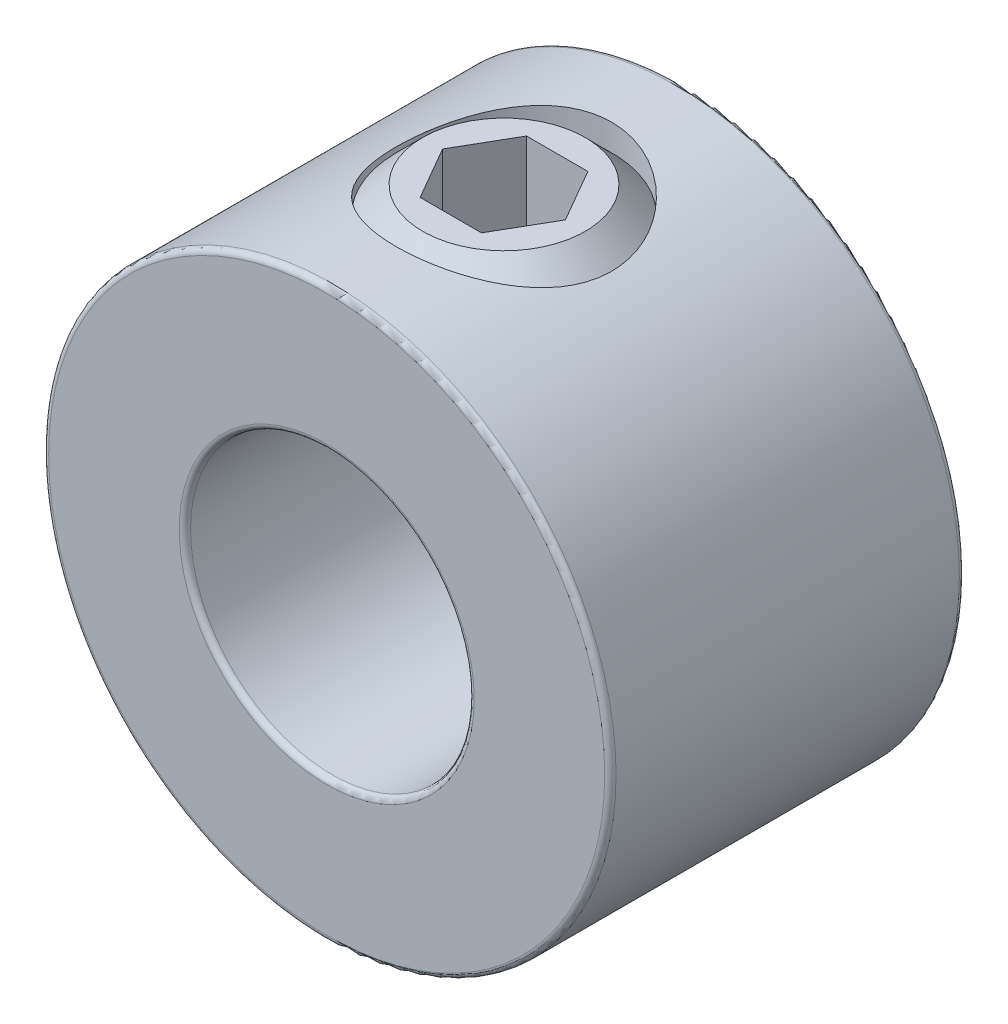
ISO-10303-21;
HEADER;
FILE_DESCRIPTION(('STEP AP214'),'2;1');
FILE_NAME('part.step','',(''),(''),'','','');
FILE_SCHEMA(('AUTOMOTIVE_DESIGN { 1 0 10303 214 1 1 1 1 }'));
ENDSEC;
DATA;
#1=APPLICATION_CONTEXT('core data for automotive mechanical design processes');
#2=APPLICATION_PROTOCOL_DEFINITION('international standard','automotive_design',2000,#1);
#3=PRODUCT_CONTEXT('',#1,'mechanical');
#4=PRODUCT('Part','Part','',(#3));
#5=PRODUCT_RELATED_PRODUCT_CATEGORY('part','',(#4));
#6=PRODUCT_DEFINITION_FORMATION('','',#4);
#7=PRODUCT_DEFINITION_CONTEXT('part definition',#1,'design');
#8=PRODUCT_DEFINITION('design','',#6,#7);
#9=PRODUCT_DEFINITION_SHAPE('','',#8);
#10=(LENGTH_UNIT() NAMED_UNIT(*) SI_UNIT(.MILLI.,.METRE.));
#11=(NAMED_UNIT(*) PLANE_ANGLE_UNIT() SI_UNIT($,.RADIAN.));
#12=(NAMED_UNIT(*) SI_UNIT($,.STERADIAN.) SOLID_ANGLE_UNIT());
#13=UNCERTAINTY_MEASURE_WITH_UNIT(LENGTH_MEASURE(1.E-05),#10,'distance_accuracy_value','');
#14=(GEOMETRIC_REPRESENTATION_CONTEXT(3) GLOBAL_UNCERTAINTY_ASSIGNED_CONTEXT((#13)) GLOBAL_UNIT_ASSIGNED_CONTEXT((#10,
#11,#12)) REPRESENTATION_CONTEXT('',''));
#15=CARTESIAN_POINT('',(0.,0.,0.));
#16=DIRECTION('',(0.,0.,1.));
#17=DIRECTION('',(1.,0.,0.));
#18=AXIS2_PLACEMENT_3D('',#15,#16,#17);
#19=CARTESIAN_POINT('',(0.,6.35,0.));
#20=DIRECTION('',(0.,1.,0.));
#21=DIRECTION('',(-1.,0.,0.));
#22=AXIS2_PLACEMENT_3D('',#19,#20,#21);
#23=PLANE('',#22);
#24=CARTESIAN_POINT('',(0.,6.35,0.));
#25=DIRECTION('',(0.,1.,0.));
#26=DIRECTION('',(-1.,0.,0.));
#27=AXIS2_PLACEMENT_3D('',#24,#25,#26);
#28=CIRCLE('',#27,1.81975161629017);
#29=CARTESIAN_POINT('',(-1.81975161629017,6.35,0.));
#30=VERTEX_POINT('',#29);
#31=EDGE_CURVE('E12',#30,#30,#28,.T.);
#32=ORIENTED_EDGE('',*,*,#31,.T.);
#33=EDGE_LOOP('',(#32));
#34=FACE_BOUND('',#33,.T.);
#35=DIRECTION('',(1.,0.,0.));
#36=VECTOR('',#35,1.);
#37=CARTESIAN_POINT('',(-0.687407664253899,6.34999999999999,-1.190625));
#38=LINE('',#37,#36);
#39=CARTESIAN_POINT('',(-0.687407664253899,6.34999999999999,-1.190625));
#40=VERTEX_POINT('',#39);
#41=CARTESIAN_POINT('',(0.687407664253899,6.35,-1.190625));
#42=VERTEX_POINT('',#41);
#43=EDGE_CURVE('E110',#40,#42,#38,.T.);
#44=ORIENTED_EDGE('',*,*,#43,.T.);
#45=DIRECTION('',(0.5,0.,0.866025403784439));
#46=VECTOR('',#45,1.);
#47=CARTESIAN_POINT('',(0.687407664253899,6.34999999999999,-1.190625));
#48=LINE('',#47,#46);
#49=CARTESIAN_POINT('',(1.3748153285078,6.34999999999999,0.));
#50=VERTEX_POINT('',#49);
#51=EDGE_CURVE('E56',#42,#50,#48,.T.);
#52=ORIENTED_EDGE('',*,*,#51,.T.);
#53=DIRECTION('',(-0.5,0.,0.866025403784439));
#54=VECTOR('',#53,1.);
#55=CARTESIAN_POINT('',(1.3748153285078,6.34999999999999,0.));
#56=LINE('',#55,#54);
#57=CARTESIAN_POINT('',(0.687407664253899,6.34999999999999,1.190625));
#58=VERTEX_POINT('',#57);
#59=EDGE_CURVE('E114',#50,#58,#56,.T.);
#60=ORIENTED_EDGE('',*,*,#59,.T.);
#61=DIRECTION('',(-1.,0.,0.));
#62=VECTOR('',#61,1.);
#63=CARTESIAN_POINT('',(0.687407664253899,6.34999999999999,1.190625));
#64=LINE('',#63,#62);
#65=CARTESIAN_POINT('',(-0.687407664253899,6.34999999999999,1.190625));
#66=VERTEX_POINT('',#65);
#67=EDGE_CURVE('E177',#58,#66,#64,.T.);
#68=ORIENTED_EDGE('',*,*,#67,.T.);
#69=DIRECTION('',(-0.5,0.,-0.866025403784439));
#70=VECTOR('',#69,1.);
#71=CARTESIAN_POINT('',(-0.687407664253899,6.34999999999999,1.190625));
#72=LINE('',#71,#70);
#73=CARTESIAN_POINT('',(-1.3748153285078,6.34999999999999,0.));
#74=VERTEX_POINT('',#73);
#75=EDGE_CURVE('E162',#66,#74,#72,.T.);
#76=ORIENTED_EDGE('',*,*,#75,.T.);
#77=DIRECTION('',(0.5,0.,-0.866025403784439));
#78=VECTOR('',#77,1.);
#79=CARTESIAN_POINT('',(-1.3748153285078,6.34999999999999,0.));
#80=LINE('',#79,#78);
#81=EDGE_CURVE('E158',#74,#40,#80,.T.);
#82=ORIENTED_EDGE('',*,*,#81,.T.);
#83=EDGE_LOOP('',(#44,#52,#60,#68,#76,#82));
#84=FACE_BOUND('',#83,.T.);
#85=ADVANCED_FACE('F42',(#34,#84),#23,.T.);
#86=CARTESIAN_POINT('',(0.,6.35,0.));
#87=DIRECTION('',(0.,-1.,0.));
#88=DIRECTION('',(1.,0.,0.));
#89=AXIS2_PLACEMENT_3D('',#86,#87,#88);
#90=CONICAL_SURFACE('',#89,1.81975161629017,0.785398163397449);
#91=CARTESIAN_POINT('',(0.,5.75675161629017,0.));
#92=DIRECTION('',(0.,1.,0.));
#93=DIRECTION('',(-1.,0.,0.));
#94=AXIS2_PLACEMENT_3D('',#91,#92,#93);
#95=CIRCLE('',#94,2.413);
#96=CARTESIAN_POINT('',(-2.413,5.75675161629017,0.));
#97=VERTEX_POINT('',#96);
#98=EDGE_CURVE('E49',#97,#97,#95,.T.);
#99=ORIENTED_EDGE('',*,*,#98,.T.);
#100=EDGE_LOOP('',(#99));
#101=FACE_BOUND('',#100,.T.);
#102=ORIENTED_EDGE('',*,*,#31,.F.);
#103=EDGE_LOOP('',(#102));
#104=FACE_BOUND('',#103,.T.);
#105=ADVANCED_FACE('F132',(#101,#104),#90,.T.);
#106=CARTESIAN_POINT('',(0.,3.175,0.));
#107=DIRECTION('',(0.,1.,0.));
#108=DIRECTION('',(-1.,0.,0.));
#109=AXIS2_PLACEMENT_3D('',#106,#107,#108);
#110=CYLINDRICAL_SURFACE('',#109,2.413);
#111=CARTESIAN_POINT('',(0.,3.76824838370983,0.));
#112=DIRECTION('',(0.,1.,0.));
#113=DIRECTION('',(-1.,0.,0.));
#114=AXIS2_PLACEMENT_3D('',#111,#112,#113);
#115=CIRCLE('',#114,2.413);
#116=CARTESIAN_POINT('',(-2.413,3.76824838370983,0.));
#117=VERTEX_POINT('',#116);
#118=EDGE_CURVE('E127',#117,#117,#115,.T.);
#119=ORIENTED_EDGE('',*,*,#118,.T.);
#120=EDGE_LOOP('',(#119));
#121=FACE_BOUND('',#120,.T.);
#122=ORIENTED_EDGE('',*,*,#98,.F.);
#123=EDGE_LOOP('',(#122));
#124=FACE_BOUND('',#123,.T.);
#125=ADVANCED_FACE('F135',(#121,#124),#110,.T.);
#126=CARTESIAN_POINT('',(0.,3.76824838370983,0.));
#127=DIRECTION('',(0.,1.,0.));
#128=DIRECTION('',(-1.,0.,0.));
#129=AXIS2_PLACEMENT_3D('',#126,#127,#128);
#130=CONICAL_SURFACE('',#129,2.413,0.785398163397448);
#131=CARTESIAN_POINT('',(0.,3.175,0.));
#132=DIRECTION('',(0.,1.,0.));
#133=DIRECTION('',(-1.,0.,0.));
#134=AXIS2_PLACEMENT_3D('',#131,#132,#133);
#135=CIRCLE('',#134,1.81975161629017);
#136=CARTESIAN_POINT('',(-1.81975161629017,3.175,0.));
#137=VERTEX_POINT('',#136);
#138=EDGE_CURVE('E119',#137,#137,#135,.T.);
#139=ORIENTED_EDGE('',*,*,#138,.T.);
#140=EDGE_LOOP('',(#139));
#141=FACE_BOUND('',#140,.T.);
#142=ORIENTED_EDGE('',*,*,#118,.F.);
#143=EDGE_LOOP('',(#142));
#144=FACE_BOUND('',#143,.T.);
#145=ADVANCED_FACE('F137',(#141,#144),#130,.T.);
#146=CARTESIAN_POINT('',(-1.81975161629017,3.175,0.));
#147=DIRECTION('',(0.,-1.,0.));
#148=DIRECTION('',(1.,0.,0.));
#149=AXIS2_PLACEMENT_3D('',#146,#147,#148);
#150=PLANE('',#149);
#151=CARTESIAN_POINT('',(0.,3.175,0.));
#152=DIRECTION('',(0.,1.,0.));
#153=DIRECTION('',(-1.,0.,0.));
#154=AXIS2_PLACEMENT_3D('',#151,#152,#153);
#155=CIRCLE('',#154,0.711898060451796);
#156=CARTESIAN_POINT('',(-0.711898060451796,3.175,0.));
#157=VERTEX_POINT('',#156);
#158=EDGE_CURVE('E115',#157,#157,#155,.T.);
#159=ORIENTED_EDGE('',*,*,#158,.T.);
#160=EDGE_LOOP('',(#159));
#161=FACE_BOUND('',#160,.T.);
#162=ORIENTED_EDGE('',*,*,#138,.F.);
#163=EDGE_LOOP('',(#162));
#164=FACE_BOUND('',#163,.T.);
#165=ADVANCED_FACE('F144',(#161,#164),#150,.T.);
#166=CARTESIAN_POINT('',(0.,3.175,0.));
#167=DIRECTION('',(0.,-1.,0.));
#168=DIRECTION('',(1.,0.,0.));
#169=AXIS2_PLACEMENT_3D('',#166,#167,#168);
#170=CONICAL_SURFACE('',#169,0.711898060451796,0.785398163397448);
#171=CARTESIAN_POINT('',(0.,3.8868980604518,0.));
#172=VERTEX_POINT('',#171);
#173=VERTEX_LOOP('',#172);
#174=FACE_BOUND('',#173,.T.);
#175=ORIENTED_EDGE('',*,*,#158,.F.);
#176=EDGE_LOOP('',(#175));
#177=FACE_BOUND('',#176,.T.);
#178=ADVANCED_FACE('F211',(#174,#177),#170,.F.);
#179=CARTESIAN_POINT('',(0.687407664253899,3.96874999999999,-1.190625));
#180=DIRECTION('',(-0.866025403784439,0.,0.5));
#181=DIRECTION('',(0.5,0.,0.866025403784438));
#182=AXIS2_PLACEMENT_3D('',#179,#180,#181);
#183=PLANE('',#182);
#184=ORIENTED_EDGE('',*,*,#51,.F.);
#185=DIRECTION('',(0.,1.,0.));
#186=VECTOR('',#185,1.);
#187=CARTESIAN_POINT('',(0.687407664253899,3.96874999999999,-1.190625));
#188=LINE('',#187,#186);
#189=CARTESIAN_POINT('',(0.687407664253899,3.96874999999999,-1.190625));
#190=VERTEX_POINT('',#189);
#191=EDGE_CURVE('E109',#190,#42,#188,.T.);
#192=ORIENTED_EDGE('',*,*,#191,.F.);
#193=DIRECTION('',(0.5,0.,0.866025403784439));
#194=VECTOR('',#193,1.);
#195=CARTESIAN_POINT('',(0.687407664253899,3.96874999999999,-1.190625));
#196=LINE('',#195,#194);
#197=CARTESIAN_POINT('',(1.3748153285078,3.96874999999999,0.));
#198=VERTEX_POINT('',#197);
#199=EDGE_CURVE('E100',#190,#198,#196,.T.);
#200=ORIENTED_EDGE('',*,*,#199,.T.);
#201=DIRECTION('',(0.,1.,0.));
#202=VECTOR('',#201,1.);
#203=CARTESIAN_POINT('',(1.3748153285078,3.96874999999999,0.));
#204=LINE('',#203,#202);
#205=EDGE_CURVE('E108',#198,#50,#204,.T.);
#206=ORIENTED_EDGE('',*,*,#205,.T.);
#207=EDGE_LOOP('',(#184,#192,#200,#206));
#208=FACE_BOUND('',#207,.T.);
#209=ADVANCED_FACE('F107',(#208),#183,.T.);
#210=CARTESIAN_POINT('',(1.3748153285078,3.96874999999999,0.));
#211=DIRECTION('',(-0.866025403784439,0.,-0.5));
#212=DIRECTION('',(-0.5,0.,0.866025403784439));
#213=AXIS2_PLACEMENT_3D('',#210,#211,#212);
#214=PLANE('',#213);
#215=ORIENTED_EDGE('',*,*,#59,.F.);
#216=ORIENTED_EDGE('',*,*,#205,.F.);
#217=DIRECTION('',(-0.5,0.,0.866025403784439));
#218=VECTOR('',#217,1.);
#219=CARTESIAN_POINT('',(1.3748153285078,3.96874999999999,0.));
#220=LINE('',#219,#218);
#221=CARTESIAN_POINT('',(0.687407664253899,3.96874999999999,1.190625));
#222=VERTEX_POINT('',#221);
#223=EDGE_CURVE('E96',#198,#222,#220,.T.);
#224=ORIENTED_EDGE('',*,*,#223,.T.);
#225=DIRECTION('',(0.,1.,0.));
#226=VECTOR('',#225,1.);
#227=CARTESIAN_POINT('',(0.687407664253899,3.96874999999999,1.190625));
#228=LINE('',#227,#226);
#229=EDGE_CURVE('E116',#222,#58,#228,.T.);
#230=ORIENTED_EDGE('',*,*,#229,.T.);
#231=EDGE_LOOP('',(#215,#216,#224,#230));
#232=FACE_BOUND('',#231,.T.);
#233=ADVANCED_FACE('F112',(#232),#214,.T.);
#234=CARTESIAN_POINT('',(0.687407664253899,3.96874999999999,1.190625));
#235=DIRECTION('',(0.,0.,-1.));
#236=DIRECTION('',(-1.,0.,0.));
#237=AXIS2_PLACEMENT_3D('',#234,#235,#236);
#238=PLANE('',#237);
#239=ORIENTED_EDGE('',*,*,#67,.F.);
#240=ORIENTED_EDGE('',*,*,#229,.F.);
#241=DIRECTION('',(-1.,0.,0.));
#242=VECTOR('',#241,1.);
#243=CARTESIAN_POINT('',(0.687407664253899,3.96874999999999,1.190625));
#244=LINE('',#243,#242);
#245=CARTESIAN_POINT('',(-0.687407664253899,3.96874999999999,1.190625));
#246=VERTEX_POINT('',#245);
#247=EDGE_CURVE('E102',#222,#246,#244,.T.);
#248=ORIENTED_EDGE('',*,*,#247,.T.);
#249=DIRECTION('',(0.,1.,0.));
#250=VECTOR('',#249,1.);
#251=CARTESIAN_POINT('',(-0.687407664253899,3.96874999999999,1.190625));
#252=LINE('',#251,#250);
#253=EDGE_CURVE('E121',#246,#66,#252,.T.);
#254=ORIENTED_EDGE('',*,*,#253,.T.);
#255=EDGE_LOOP('',(#239,#240,#248,#254));
#256=FACE_BOUND('',#255,.T.);
#257=ADVANCED_FACE('F175',(#256),#238,.T.);
#258=CARTESIAN_POINT('',(-0.687407664253899,3.96874999999999,1.190625));
#259=DIRECTION('',(0.866025403784439,0.,-0.5));
#260=DIRECTION('',(-0.5,0.,-0.866025403784439));
#261=AXIS2_PLACEMENT_3D('',#258,#259,#260);
#262=PLANE('',#261);
#263=ORIENTED_EDGE('',*,*,#75,.F.);
#264=ORIENTED_EDGE('',*,*,#253,.F.);
#265=DIRECTION('',(-0.5,0.,-0.866025403784439));
#266=VECTOR('',#265,1.);
#267=CARTESIAN_POINT('',(-0.687407664253899,3.96874999999999,1.190625));
#268=LINE('',#267,#266);
#269=CARTESIAN_POINT('',(-1.3748153285078,3.96874999999999,0.));
#270=VERTEX_POINT('',#269);
#271=EDGE_CURVE('E188',#246,#270,#268,.T.);
#272=ORIENTED_EDGE('',*,*,#271,.T.);
#273=DIRECTION('',(0.,1.,0.));
#274=VECTOR('',#273,1.);
#275=CARTESIAN_POINT('',(-1.3748153285078,3.96874999999999,0.));
#276=LINE('',#275,#274);
#277=EDGE_CURVE('E170',#270,#74,#276,.T.);
#278=ORIENTED_EDGE('',*,*,#277,.T.);
#279=EDGE_LOOP('',(#263,#264,#272,#278));
#280=FACE_BOUND('',#279,.T.);
#281=ADVANCED_FACE('F179',(#280),#262,.T.);
#282=CARTESIAN_POINT('',(-1.3748153285078,3.96874999999999,0.));
#283=DIRECTION('',(0.866025403784439,0.,0.5));
#284=DIRECTION('',(0.5,0.,-0.866025403784439));
#285=AXIS2_PLACEMENT_3D('',#282,#283,#284);
#286=PLANE('',#285);
#287=ORIENTED_EDGE('',*,*,#81,.F.);
#288=ORIENTED_EDGE('',*,*,#277,.F.);
#289=DIRECTION('',(0.5,0.,-0.866025403784439));
#290=VECTOR('',#289,1.);
#291=CARTESIAN_POINT('',(-1.3748153285078,3.96874999999999,0.));
#292=LINE('',#291,#290);
#293=CARTESIAN_POINT('',(-0.687407664253899,3.96874999999999,-1.190625));
#294=VERTEX_POINT('',#293);
#295=EDGE_CURVE('E186',#270,#294,#292,.T.);
#296=ORIENTED_EDGE('',*,*,#295,.T.);
#297=DIRECTION('',(0.,1.,0.));
#298=VECTOR('',#297,1.);
#299=CARTESIAN_POINT('',(-0.687407664253899,3.96874999999999,-1.190625));
#300=LINE('',#299,#298);
#301=EDGE_CURVE('E167',#294,#40,#300,.T.);
#302=ORIENTED_EDGE('',*,*,#301,.T.);
#303=EDGE_LOOP('',(#287,#288,#296,#302));
#304=FACE_BOUND('',#303,.T.);
#305=ADVANCED_FACE('F192',(#304),#286,.T.);
#306=CARTESIAN_POINT('',(-0.687407664253899,3.96874999999999,-1.190625));
#307=DIRECTION('',(0.,0.,1.));
#308=DIRECTION('',(1.,0.,0.));
#309=AXIS2_PLACEMENT_3D('',#306,#307,#308);
#310=PLANE('',#309);
#311=ORIENTED_EDGE('',*,*,#43,.F.);
#312=ORIENTED_EDGE('',*,*,#301,.F.);
#313=DIRECTION('',(1.,0.,0.));
#314=VECTOR('',#313,1.);
#315=CARTESIAN_POINT('',(-0.687407664253899,3.96874999999999,-1.190625));
#316=LINE('',#315,#314);
#317=EDGE_CURVE('E168',#294,#190,#316,.T.);
#318=ORIENTED_EDGE('',*,*,#317,.T.);
#319=ORIENTED_EDGE('',*,*,#191,.T.);
#320=EDGE_LOOP('',(#311,#312,#318,#319));
#321=FACE_BOUND('',#320,.T.);
#322=ADVANCED_FACE('F193',(#321),#310,.T.);
#323=CARTESIAN_POINT('',(1.3748153285078,3.96874999999999,0.));
#324=DIRECTION('',(0.,-1.,0.));
#325=DIRECTION('',(0.,0.,-1.));
#326=AXIS2_PLACEMENT_3D('',#323,#324,#325);
#327=PLANE('',#326);
#328=ORIENTED_EDGE('',*,*,#199,.F.);
#329=ORIENTED_EDGE('',*,*,#317,.F.);
#330=ORIENTED_EDGE('',*,*,#295,.F.);
#331=ORIENTED_EDGE('',*,*,#271,.F.);
#332=ORIENTED_EDGE('',*,*,#247,.F.);
#333=ORIENTED_EDGE('',*,*,#223,.F.);
#334=EDGE_LOOP('',(#328,#329,#330,#331,#332,#333));
#335=FACE_BOUND('',#334,.T.);
#336=ADVANCED_FACE('F98',(#335),#327,.F.);
#337=CLOSED_SHELL('',(#85,#105,#125,#145,#165,#178,#209,#233,#257,#281,#305,#322,#336));
#338=MANIFOLD_SOLID_BREP('B2',#337);
#339=CARTESIAN_POINT('',(0.,0.,3.96875));
#340=DIRECTION('',(0.,0.,1.));
#341=DIRECTION('',(1.,0.,0.));
#342=AXIS2_PLACEMENT_3D('',#339,#340,#341);
#343=PLANE('',#342);
#344=CARTESIAN_POINT('',(0.,0.,3.96875));
#345=DIRECTION('',(0.,0.,1.));
#346=DIRECTION('',(1.,0.,0.));
#347=AXIS2_PLACEMENT_3D('',#344,#345,#346);
#348=CIRCLE('',#347,3.302);
#349=CARTESIAN_POINT('',(3.302,0.,3.96875));
#350=VERTEX_POINT('',#349);
#351=EDGE_CURVE('E307',#350,#350,#348,.F.);
#352=ORIENTED_EDGE('',*,*,#351,.T.);
#353=EDGE_LOOP('',(#352));
#354=FACE_BOUND('',#353,.T.);
#355=CARTESIAN_POINT('',(0.,0.,3.96875));
#356=DIRECTION('',(0.,0.,1.));
#357=DIRECTION('',(1.,0.,0.));
#358=AXIS2_PLACEMENT_3D('',#355,#356,#357);
#359=CIRCLE('',#358,6.223);
#360=CARTESIAN_POINT('',(6.223,0.,3.96875));
#361=VERTEX_POINT('',#360);
#362=EDGE_CURVE('E311',#361,#361,#359,.T.);
#363=ORIENTED_EDGE('',*,*,#362,.T.);
#364=EDGE_LOOP('',(#363));
#365=FACE_BOUND('',#364,.T.);
#366=ADVANCED_FACE('F296',(#354,#365),#343,.T.);
#367=CARTESIAN_POINT('',(0.,0.,-3.96875));
#368=DIRECTION('',(0.,0.,1.));
#369=DIRECTION('',(1.,0.,0.));
#370=AXIS2_PLACEMENT_3D('',#367,#368,#369);
#371=PLANE('',#370);
#372=CARTESIAN_POINT('',(0.,0.,-3.96875));
#373=DIRECTION('',(0.,0.,1.));
#374=DIRECTION('',(1.,0.,0.));
#375=AXIS2_PLACEMENT_3D('',#372,#373,#374);
#376=CIRCLE('',#375,3.302);
#377=CARTESIAN_POINT('',(3.302,0.,-3.96875));
#378=VERTEX_POINT('',#377);
#379=EDGE_CURVE('E322',#378,#378,#376,.T.);
#380=ORIENTED_EDGE('',*,*,#379,.T.);
#381=EDGE_LOOP('',(#380));
#382=FACE_BOUND('',#381,.T.);
#383=CARTESIAN_POINT('',(0.,0.,-3.96875));
#384=DIRECTION('',(0.,0.,1.));
#385=DIRECTION('',(1.,0.,0.));
#386=AXIS2_PLACEMENT_3D('',#383,#384,#385);
#387=CIRCLE('',#386,6.223);
#388=CARTESIAN_POINT('',(6.223,0.,-3.96875));
#389=VERTEX_POINT('',#388);
#390=EDGE_CURVE('E325',#389,#389,#387,.F.);
#391=ORIENTED_EDGE('',*,*,#390,.T.);
#392=EDGE_LOOP('',(#391));
#393=FACE_BOUND('',#392,.T.);
#394=ADVANCED_FACE('F359',(#382,#393),#371,.F.);
#395=CARTESIAN_POINT('',(0.,0.,3.96875));
#396=DIRECTION('',(0.,0.,-1.));
#397=DIRECTION('',(-1.,0.,0.));
#398=AXIS2_PLACEMENT_3D('',#395,#396,#397);
#399=CYLINDRICAL_SURFACE('',#398,6.35);
#400=CARTESIAN_POINT('',(0.,0.,-3.84175));
#401=DIRECTION('',(0.,0.,1.));
#402=DIRECTION('',(1.,0.,0.));
#403=AXIS2_PLACEMENT_3D('',#400,#401,#402);
#404=CIRCLE('',#403,6.35);
#405=CARTESIAN_POINT('',(6.35,0.,-3.84175));
#406=VERTEX_POINT('',#405);
#407=EDGE_CURVE('E41',#406,#406,#404,.T.);
#408=ORIENTED_EDGE('',*,*,#407,.T.);
#409=EDGE_LOOP('',(#408));
#410=FACE_BOUND('',#409,.T.);
#411=CARTESIAN_POINT('',(0.,0.,3.84175));
#412=DIRECTION('',(0.,0.,1.));
#413=DIRECTION('',(1.,0.,0.));
#414=AXIS2_PLACEMENT_3D('',#411,#412,#413);
#415=CIRCLE('',#414,6.35);
#416=CARTESIAN_POINT('',(6.35,0.,3.84175));
#417=VERTEX_POINT('',#416);
#418=EDGE_CURVE('E303',#417,#417,#415,.F.);
#419=ORIENTED_EDGE('',*,*,#418,.T.);
#420=EDGE_LOOP('',(#419));
#421=FACE_BOUND('',#420,.T.);
#422=CARTESIAN_POINT('',(0.,6.35,-2.413));
#423=CARTESIAN_POINT('',(0.130555931467962,6.35000398969011,-2.41300527534602));
#424=CARTESIAN_POINT('',(0.261076241377739,6.34593890816647,-2.4023714543113));
#425=CARTESIAN_POINT('',(0.518209446534913,6.33012963929965,-2.36029479676423));
#426=CARTESIAN_POINT('',(0.644823015088655,6.31838678300935,-2.32885556715778));
#427=CARTESIAN_POINT('',(0.890396734122701,6.28848040494,-2.24644511602075));
#428=CARTESIAN_POINT('',(1.00937135935963,6.27032947705095,-2.19551218938446));
#429=CARTESIAN_POINT('',(1.23707694907279,6.22940932060409,-2.07575764561934));
#430=CARTESIAN_POINT('',(1.34580507871092,6.20663881943741,-2.00693109764769));
#431=CARTESIAN_POINT('',(1.5546544090621,6.15771932779737,-1.85022277092613));
#432=CARTESIAN_POINT('',(1.65427192875035,6.13147296383124,-1.76170041624995));
#433=CARTESIAN_POINT('',(1.83765571561736,6.07903240405007,-1.56947315042905));
#434=CARTESIAN_POINT('',(1.92141693988139,6.05283822744466,-1.46576342765122));
#435=CARTESIAN_POINT('',(2.07395660623911,6.00232668170519,-1.24113386470124));
#436=CARTESIAN_POINT('',(2.14201618015845,5.97812365120729,-1.11969756154783));
#437=CARTESIAN_POINT('',(2.25652093858858,5.93585432476053,-0.866038380432351));
#438=CARTESIAN_POINT('',(2.30297502037546,5.91778550353544,-0.733819969020803));
#439=CARTESIAN_POINT('',(2.37094947712185,5.89087364983883,-0.46815363189803));
#440=CARTESIAN_POINT('',(2.39343294050412,5.88167580744491,-0.334989300795486));
#441=CARTESIAN_POINT('',(2.41583880524757,5.87251090464605,-0.0664845962936197));
#442=CARTESIAN_POINT('',(2.41577084821779,5.87253989940926,0.0688548224232351));
#443=CARTESIAN_POINT('',(2.39381090108878,5.88152011871453,0.328972227003014));
#444=CARTESIAN_POINT('',(2.37326609797153,5.88992057372023,0.453886522563246));
#445=CARTESIAN_POINT('',(2.31316652422954,5.91378008823147,0.698339704990829));
#446=CARTESIAN_POINT('',(2.27360881167116,5.92924024008996,0.817877756841903));
#447=CARTESIAN_POINT('',(2.17588364092748,5.96580146890692,1.0508916152852));
#448=CARTESIAN_POINT('',(2.11737290423754,5.98700531598431,1.16420661484106));
#449=CARTESIAN_POINT('',(1.98364217411328,6.03263175509447,1.37979639920587));
#450=CARTESIAN_POINT('',(1.90841630395244,6.05705547794376,1.4820672822727));
#451=CARTESIAN_POINT('',(1.73726689770536,6.10842961274997,1.68010694238863));
#452=CARTESIAN_POINT('',(1.64027173491613,6.13543795015635,1.77493688260015));
#453=CARTESIAN_POINT('',(1.43144868882472,6.18748920351012,1.94726806056401));
#454=CARTESIAN_POINT('',(1.31961840653187,6.2125318005324,2.02476649017818));
#455=CARTESIAN_POINT('',(1.08185265975391,6.25835188225341,2.16130771487283));
#456=CARTESIAN_POINT('',(0.955717417234618,6.27905339803369,2.22002994310971));
#457=CARTESIAN_POINT('',(0.694375189035109,6.31329326294077,2.31510736575226));
#458=CARTESIAN_POINT('',(0.559172376611221,6.32683488218724,2.3514727723643));
#459=CARTESIAN_POINT('',(0.291428150212525,6.3446501972992,2.39898109857718));
#460=CARTESIAN_POINT('',(0.159141645079808,6.34938771868047,2.41138775288999));
#461=CARTESIAN_POINT('',(-0.105693065348276,6.35049981057155,2.41431626348443));
#462=CARTESIAN_POINT('',(-0.238241203822052,6.34687629478166,2.40484312768025));
#463=CARTESIAN_POINT('',(-0.494323602805378,6.33197908606406,2.36523562382545));
#464=CARTESIAN_POINT('',(-0.61800684441211,6.32101461634214,2.33593589818825));
#465=CARTESIAN_POINT('',(-0.858609565436108,6.29285092848222,2.25861304376362));
#466=CARTESIAN_POINT('',(-0.975528163914414,6.27565090041604,2.21058748264173));
#467=CARTESIAN_POINT('',(-1.20317276582384,6.23607457125026,2.09563503714011));
#468=CARTESIAN_POINT('',(-1.3136121499673,6.21355984396609,2.02818967610491));
#469=CARTESIAN_POINT('',(-1.52197988578177,6.16583504517286,1.87689595883598));
#470=CARTESIAN_POINT('',(-1.61990351002366,6.14062396176678,1.79304143465584));
#471=CARTESIAN_POINT('',(-1.80656807112922,6.08841217199752,1.60543272496061));
#472=CARTESIAN_POINT('',(-1.89441393314817,6.06139435477813,1.5007904098217));
#473=CARTESIAN_POINT('',(-2.05148411432654,6.01005496187559,1.27772800811267));
#474=CARTESIAN_POINT('',(-2.12070651399853,5.98573366426972,1.15930650314625));
#475=CARTESIAN_POINT('',(-2.23870023772464,5.94261798623815,0.910922748538602));
#476=CARTESIAN_POINT('',(-2.28736466342468,5.92385264334907,0.780904332023381));
#477=CARTESIAN_POINT('',(-2.36177800946808,5.89458517077402,0.513602694331982));
#478=CARTESIAN_POINT('',(-2.38754162954713,5.8840777409413,0.376324193363579));
#479=CARTESIAN_POINT('',(-2.41408994040532,5.87323215610138,0.108127165215383));
#480=CARTESIAN_POINT('',(-2.41640623148607,5.87227054588007,-0.0226157343841075));
#481=CARTESIAN_POINT('',(-2.3999373204655,5.8790202253426,-0.282524873396556));
#482=CARTESIAN_POINT('',(-2.38115423316032,5.88673064582666,-0.41169126951125));
#483=CARTESIAN_POINT('',(-2.32422421188573,5.90943043237583,-0.660552265849344));
#484=CARTESIAN_POINT('',(-2.28672002796391,5.92417751295514,-0.780417919491674));
#485=CARTESIAN_POINT('',(-2.19398528189399,5.95914188552999,-1.01222145618602));
#486=CARTESIAN_POINT('',(-2.13875018285588,5.97936057736356,-1.12415730124382));
#487=CARTESIAN_POINT('',(-2.00869997639504,6.02433337271119,-1.34342800575803));
#488=CARTESIAN_POINT('',(-1.93299650808671,6.04927206356278,-1.4501976241717));
#489=CARTESIAN_POINT('',(-1.76551836882645,6.10025417003155,-1.65000619367226));
#490=CARTESIAN_POINT('',(-1.67373852090438,6.12629793945648,-1.74304070389426));
#491=CARTESIAN_POINT('',(-1.47055494697206,6.17831294001547,-1.91807209951937));
#492=CARTESIAN_POINT('',(-1.35833856072122,6.20419794006484,-1.99915556641372));
#493=CARTESIAN_POINT('',(-1.12096041375387,6.25144642675378,-2.14129762074769));
#494=CARTESIAN_POINT('',(-0.995797050693124,6.27280935273315,-2.20235372565052));
#495=CARTESIAN_POINT('',(-0.728778395788011,6.30955475572144,-2.30499263616226));
#496=CARTESIAN_POINT('',(-0.58638469778337,6.32454657619379,-2.3453288052365));
#497=CARTESIAN_POINT('',(-0.295976705251577,6.34476431329028,-2.39932232882264));
#498=CARTESIAN_POINT('',(-0.147965475024477,6.34999547828747,-2.41299402119021));
#499=CARTESIAN_POINT('',(0.,6.35,-2.413));
#500=B_SPLINE_CURVE_WITH_KNOTS('',3,(#422,#423,#424,#425,#426,#427,#428,#429,#430,#431,#432,
#433,#434,#435,#436,#437,#438,#439,#440,#441,#442,#443,#444,#445,#446,#447,#448,#449,#450,#451,
#452,#453,#454,#455,#456,#457,#458,#459,#460,#461,#462,#463,#464,#465,#466,#467,#468,#469,#470,
#471,#472,#473,#474,#475,#476,#477,#478,#479,#480,#481,#482,#483,#484,#485,#486,#487,#488,#489,
#490,#491,#492,#493,#494,#495,#496,#497,#498,#499),.UNSPECIFIED.,.T.,.F.,(4,2,2,2,2,2,2,2,2,2,2,
2,2,2,2,2,2,2,2,2,2,2,2,2,2,2,2,2,2,2,2,2,2,2,2,2,2,2,4),(0.,0.391121887064184,
0.782175985486185,1.17246577830223,1.56286323524963,1.96854634212709,2.37435825594016,
2.79613130529395,3.21773051175688,3.62166628723491,4.02542936468621,4.40427313209371,
4.78317553819666,5.16936515238192,5.55569075901495,5.96873424705112,6.38184461005431,
6.80167192308661,7.22130732355892,7.61812936188612,8.01486058335588,8.39585156202364,
8.77689204483065,9.16923685274999,9.56172942118012,9.9776135359701,10.3935404987953,
10.8116043631128,11.2293996833676,11.6197130905881,12.0099873800853,12.3876994067832,
12.7655081575183,13.1635000328781,13.5616203073395,13.9821012344605,14.4026342635628,
14.8461505355472,15.2894282569131),.UNSPECIFIED.);
#501=CARTESIAN_POINT('',(0.,6.35,-2.413));
#502=VERTEX_POINT('',#501);
#503=EDGE_CURVE('E328',#502,#502,#500,.T.);
#504=ORIENTED_EDGE('',*,*,#503,.T.);
#505=EDGE_LOOP('',(#504));
#506=FACE_BOUND('',#505,.T.);
#507=ADVANCED_FACE('F355',(#410,#421,#506),#399,.T.);
#508=CARTESIAN_POINT('',(0.,0.,3.96875));
#509=DIRECTION('',(0.,0.,-1.));
#510=DIRECTION('',(-1.,0.,0.));
#511=AXIS2_PLACEMENT_3D('',#508,#509,#510);
#512=CYLINDRICAL_SURFACE('',#511,3.175);
#513=CARTESIAN_POINT('',(0.,0.,-3.84175));
#514=DIRECTION('',(0.,0.,1.));
#515=DIRECTION('',(1.,0.,0.));
#516=AXIS2_PLACEMENT_3D('',#513,#514,#515);
#517=CIRCLE('',#516,3.175);
#518=CARTESIAN_POINT('',(3.175,0.,-3.84175));
#519=VERTEX_POINT('',#518);
#520=EDGE_CURVE('E316',#519,#519,#517,.F.);
#521=ORIENTED_EDGE('',*,*,#520,.T.);
#522=EDGE_LOOP('',(#521));
#523=FACE_BOUND('',#522,.T.);
#524=CARTESIAN_POINT('',(0.,0.,3.84175));
#525=DIRECTION('',(0.,0.,1.));
#526=DIRECTION('',(1.,0.,0.));
#527=AXIS2_PLACEMENT_3D('',#524,#525,#526);
#528=CIRCLE('',#527,3.175);
#529=CARTESIAN_POINT('',(3.175,0.,3.84175));
#530=VERTEX_POINT('',#529);
#531=EDGE_CURVE('E319',#530,#530,#528,.T.);
#532=ORIENTED_EDGE('',*,*,#531,.T.);
#533=EDGE_LOOP('',(#532));
#534=FACE_BOUND('',#533,.T.);
#535=CARTESIAN_POINT('',(0.,3.175,-2.413));
#536=CARTESIAN_POINT('',(0.117443171605231,3.17499092904906,-2.41299058031907));
#537=CARTESIAN_POINT('',(0.23503818841931,3.16841692674332,-2.4043581847269));
#538=CARTESIAN_POINT('',(0.466484967913331,3.14271336140829,-2.37038175457781));
#539=CARTESIAN_POINT('',(0.580328596183407,3.12355818632314,-2.34500362950094));
#540=CARTESIAN_POINT('',(0.80033693546367,3.07452724978738,-2.27928432631256));
#541=CARTESIAN_POINT('',(0.906543039514099,3.04471549355359,-2.23903243487973));
#542=CARTESIAN_POINT('',(1.10997011785933,2.97659455342082,-2.14548015839209));
#543=CARTESIAN_POINT('',(1.20719255384311,2.93828675533249,-2.09218190121579));
#544=CARTESIAN_POINT('',(1.40022726688529,2.85170030734834,-1.96882085307546));
#545=CARTESIAN_POINT('',(1.49506365463583,2.80282512985173,-1.89765858122501));
#546=CARTESIAN_POINT('',(1.67223382567996,2.7008760546092,-1.7435641158176));
#547=CARTESIAN_POINT('',(1.75454859398162,2.64779595363648,-1.66061438438314));
#548=CARTESIAN_POINT('',(1.92203888294129,2.5296135351956,-1.46565859240837));
#549=CARTESIAN_POINT('',(2.00423140536036,2.4643124367144,-1.35120048467098));
#550=CARTESIAN_POINT('',(2.14857118710811,2.33951215894306,-1.10735736644856));
#551=CARTESIAN_POINT('',(2.21074385995913,2.28000569136514,-0.977991565717825));
#552=CARTESIAN_POINT('',(2.29462037317499,2.19490180220151,-0.752497308608559));
#553=CARTESIAN_POINT('',(2.32287346332998,2.16472241167552,-0.66055827907226));
#554=CARTESIAN_POINT('',(2.36849823013454,2.11470881226284,-0.47139038700259));
#555=CARTESIAN_POINT('',(2.38589523743028,2.09485053921884,-0.374174418255039));
#556=CARTESIAN_POINT('',(2.40870358471578,2.06860028206587,-0.175460476777278));
#557=CARTESIAN_POINT('',(2.4139959431512,2.06234200752845,-0.073929905731699));
#558=CARTESIAN_POINT('',(2.41169213967819,2.06503422028968,0.128798184800726));
#559=CARTESIAN_POINT('',(2.40409306334661,2.07398814667793,0.22999562379254));
#560=CARTESIAN_POINT('',(2.37836508518799,2.10340433920656,0.416917246134645));
#561=CARTESIAN_POINT('',(2.36156171265492,2.1224091464969,0.503073429560243));
#562=CARTESIAN_POINT('',(2.31942910669347,2.16837457604816,0.671064962974234));
#563=CARTESIAN_POINT('',(2.29409116468348,2.19534332114491,0.752895800354834));
#564=CARTESIAN_POINT('',(2.21702947004233,2.27376916611904,0.962631680289748));
#565=CARTESIAN_POINT('',(2.15880606368402,2.32983777456744,1.08642083974007));
#566=CARTESIAN_POINT('',(2.0240584670168,2.44783368287627,1.32063556736185));
#567=CARTESIAN_POINT('',(1.94748865288627,2.50977535205404,1.43102676980356));
#568=CARTESIAN_POINT('',(1.77457755480707,2.63500191833982,1.64086400526623));
#569=CARTESIAN_POINT('',(1.67772908569284,2.69827393808612,1.73990181478264));
#570=CARTESIAN_POINT('',(1.46641465679805,2.81868720555883,1.92133244794249));
#571=CARTESIAN_POINT('',(1.35198192561174,2.87583967861316,2.00375600179513));
#572=CARTESIAN_POINT('',(1.1302184691796,2.96897239724258,2.13504920976438));
#573=CARTESIAN_POINT('',(1.02573469648465,3.00691100546587,2.18732233798596));
#574=CARTESIAN_POINT('',(0.807524498934965,3.07269924184988,2.27691743542351));
#575=CARTESIAN_POINT('',(0.693803632023793,3.10055488265641,2.31424831636675));
#576=CARTESIAN_POINT('',(0.458986561176873,3.14392869528766,2.37204565582169));
#577=CARTESIAN_POINT('',(0.337846653718269,3.15936426972399,2.39239924216467));
#578=CARTESIAN_POINT('',(0.0929212408274502,3.17600778354888,2.41433718167044));
#579=CARTESIAN_POINT('',(-0.0308628412677098,3.17722319336241,2.41593138989231));
#580=CARTESIAN_POINT('',(-0.263113673769308,3.16598164725166,2.40112430213952));
#581=CARTESIAN_POINT('',(-0.371784896474092,3.15499411480433,2.38665711938384));
#582=CARTESIAN_POINT('',(-0.584657379974265,3.12256258934286,2.34361709819449));
#583=CARTESIAN_POINT('',(-0.688857782558675,3.10111659842469,2.31504156459624));
#584=CARTESIAN_POINT('',(-0.893151752270642,3.04866013703249,2.24429284461138));
#585=CARTESIAN_POINT('',(-0.993066473951875,3.01741404656932,2.20178337061745));
#586=CARTESIAN_POINT('',(-1.18427030490273,2.94762615076737,2.10512741976429));
#587=CARTESIAN_POINT('',(-1.27555811070553,2.90908324556455,2.05097918840424));
#588=CARTESIAN_POINT('',(-1.4629408219305,2.82008518778891,1.92283493337221));
#589=CARTESIAN_POINT('',(-1.55736336530955,2.76871323654288,1.84703979297132));
#590=CARTESIAN_POINT('',(-1.7330266340156,2.66229345480278,1.68334400808498));
#591=CARTESIAN_POINT('',(-1.81424018707203,2.60723836781931,1.59541908083344));
#592=CARTESIAN_POINT('',(-1.93310120506622,2.51929011373857,1.44596227809647));
#593=CARTESIAN_POINT('',(-1.97518148865632,2.48634042838264,1.38794003709871));
#594=CARTESIAN_POINT('',(-2.05424288960517,2.42143291492003,1.26799956797446));
#595=CARTESIAN_POINT('',(-2.09122218168265,2.38947544500995,1.2060799567393));
#596=CARTESIAN_POINT('',(-2.19405069763864,2.29677780916441,1.01470921513655));
#597=CARTESIAN_POINT('',(-2.25209423008379,2.2389759481709,0.879267670433414));
#598=CARTESIAN_POINT('',(-2.32600727289693,2.16148731453314,0.648667618119571));
#599=CARTESIAN_POINT('',(-2.34951337659766,2.13568591161393,0.557995127674168));
#600=CARTESIAN_POINT('',(-2.38597736286025,2.09487284834006,0.372275602812797));
#601=CARTESIAN_POINT('',(-2.39896041795918,2.0798354491901,0.277239585981548));
#602=CARTESIAN_POINT('',(-2.41347202601588,2.06298898322372,0.0843820043038626));
#603=CARTESIAN_POINT('',(-2.41491881071071,2.06127434940024,-0.0134545208329241));
#604=CARTESIAN_POINT('',(-2.40600289841214,2.07166816759277,-0.20788213648133));
#605=CARTESIAN_POINT('',(-2.39562846174622,2.08379036100337,-0.304471892411458));
#606=CARTESIAN_POINT('',(-2.36137219311358,2.12256830664758,-0.508834367656112));
#607=CARTESIAN_POINT('',(-2.33557340769404,2.15126142901359,-0.615881798172457));
#608=CARTESIAN_POINT('',(-2.27108364148613,2.21923176610734,-0.822515613730422));
#609=CARTESIAN_POINT('',(-2.2323592210675,2.25853638265596,-0.922081817130457));
#610=CARTESIAN_POINT('',(-2.12610942507655,2.35955877527054,-1.15053309693759));
#611=CARTESIAN_POINT('',(-2.05324191025264,2.42403799567888,-1.27569998264042));
#612=CARTESIAN_POINT('',(-1.88728411653423,2.55539518076956,-1.5104318596925));
#613=CARTESIAN_POINT('',(-1.79417076882036,2.62227580852244,-1.61997881541957));
#614=CARTESIAN_POINT('',(-1.58693666845894,2.75272337581287,-1.82362287315767));
#615=CARTESIAN_POINT('',(-1.47252844795802,2.81622750409905,-1.9174704362987));
#616=CARTESIAN_POINT('',(-1.22472214874906,2.93245405690648,-2.0844185884594));
#617=CARTESIAN_POINT('',(-1.09136873492959,2.9852011492147,-2.15756679766189));
#618=CARTESIAN_POINT('',(-0.848324156263042,3.06143310070406,-2.2616762509508));
#619=CARTESIAN_POINT('',(-0.742491250018576,3.08897584082985,-2.29871569194653));
#620=CARTESIAN_POINT('',(-0.524711420429954,3.13329848559572,-2.35794338327758));
#621=CARTESIAN_POINT('',(-0.412780537897338,3.1501052759874,-2.38016873825137));
#622=CARTESIAN_POINT('',(-0.249887399880881,3.16554486424948,-2.40054788675386));
#623=CARTESIAN_POINT('',(-0.200104041382905,3.16908209053624,-2.40520884201812));
#624=CARTESIAN_POINT('',(-0.10022305414221,3.17381185752955,-2.41143725628489));
#625=CARTESIAN_POINT('',(-0.0501253573366512,3.17500387152911,-2.41300402036888));
#626=CARTESIAN_POINT('',(0.,3.175,-2.413));
#627=B_SPLINE_CURVE_WITH_KNOTS('',3,(#535,#536,#537,#538,#539,#540,#541,#542,#543,#544,#545,
#546,#547,#548,#549,#550,#551,#552,#553,#554,#555,#556,#557,#558,#559,#560,#561,#562,#563,#564,
#565,#566,#567,#568,#569,#570,#571,#572,#573,#574,#575,#576,#577,#578,#579,#580,#581,#582,#583,
#584,#585,#586,#587,#588,#589,#590,#591,#592,#593,#594,#595,#596,#597,#598,#599,#600,#601,#602,
#603,#604,#605,#606,#607,#608,#609,#610,#611,#612,#613,#614,#615,#616,#617,#618,#619,#620,#621,
#622,#623,#624,#625,#626),.UNSPECIFIED.,.T.,.F.,(4,2,2,2,2,2,2,2,2,2,2,2,2,2,2,2,2,2,2,2,2,2,2,
2,2,2,2,2,2,2,2,2,2,2,2,2,2,2,2,2,2,2,2,2,2,4),(0.,0.352113770291782,0.704946585369681,
1.05569488379078,1.40638601280107,1.78976092813112,2.17371233600607,2.63773050853704,
3.10115730525324,3.40258553658297,3.70330778533679,4.00697348207613,4.31070783899934,
4.57916413533347,4.84789519559245,5.28900480236595,5.73122295780719,6.18621377116464,
6.64035513804427,7.00739894320242,7.37422351187941,7.74346787257931,8.11251824563582,
8.44151894934109,8.77058252746343,9.10825790412116,9.44598421987268,9.83917081589853,
10.2331562784928,10.469557715449,10.7060435254032,11.1774135342105,11.4679029980311,
11.757695504225,12.0495402292483,12.3416750384965,12.6811651199407,13.0215403855346,
13.4947220530831,13.9684457327182,14.4491015240246,14.9286423754468,15.2736416515379,
15.6177735325977,15.768023783139,15.9183077742625),.UNSPECIFIED.);
#628=CARTESIAN_POINT('',(0.,3.175,-2.413));
#629=VERTEX_POINT('',#628);
#630=EDGE_CURVE('E329',#629,#629,#627,.T.);
#631=ORIENTED_EDGE('',*,*,#630,.F.);
#632=EDGE_LOOP('',(#631));
#633=FACE_BOUND('',#632,.T.);
#634=ADVANCED_FACE('F339',(#523,#534,#633),#512,.F.);
#635=CARTESIAN_POINT('',(0.,6.35,0.));
#636=DIRECTION('',(0.,-1.,0.));
#637=DIRECTION('',(0.,0.,-1.));
#638=AXIS2_PLACEMENT_3D('',#635,#636,#637);
#639=CYLINDRICAL_SURFACE('',#638,2.413);
#640=ORIENTED_EDGE('',*,*,#630,.T.);
#641=EDGE_LOOP('',(#640));
#642=FACE_BOUND('',#641,.T.);
#643=ORIENTED_EDGE('',*,*,#503,.F.);
#644=EDGE_LOOP('',(#643));
#645=FACE_BOUND('',#644,.T.);
#646=ADVANCED_FACE('F342',(#642,#645),#639,.F.);
#647=CARTESIAN_POINT('',(0.,0.,-3.84175));
#648=DIRECTION('',(0.,0.,1.));
#649=DIRECTION('',(1.,0.,0.));
#650=AXIS2_PLACEMENT_3D('',#647,#648,#649);
#651=TOROIDAL_SURFACE('',#650,3.302,0.127);
#652=ORIENTED_EDGE('',*,*,#520,.F.);
#653=EDGE_LOOP('',(#652));
#654=FACE_BOUND('',#653,.T.);
#655=ORIENTED_EDGE('',*,*,#379,.F.);
#656=EDGE_LOOP('',(#655));
#657=FACE_BOUND('',#656,.T.);
#658=ADVANCED_FACE('F345',(#654,#657),#651,.T.);
#659=CARTESIAN_POINT('',(0.,0.,3.84175));
#660=DIRECTION('',(0.,0.,1.));
#661=DIRECTION('',(1.,0.,0.));
#662=AXIS2_PLACEMENT_3D('',#659,#660,#661);
#663=TOROIDAL_SURFACE('',#662,3.302,0.127);
#664=ORIENTED_EDGE('',*,*,#351,.F.);
#665=EDGE_LOOP('',(#664));
#666=FACE_BOUND('',#665,.T.);
#667=ORIENTED_EDGE('',*,*,#531,.F.);
#668=EDGE_LOOP('',(#667));
#669=FACE_BOUND('',#668,.T.);
#670=ADVANCED_FACE('F352',(#666,#669),#663,.T.);
#671=CARTESIAN_POINT('',(0.,0.,-3.84175));
#672=DIRECTION('',(0.,0.,1.));
#673=DIRECTION('',(1.,0.,0.));
#674=AXIS2_PLACEMENT_3D('',#671,#672,#673);
#675=TOROIDAL_SURFACE('',#674,6.223,0.127);
#676=ORIENTED_EDGE('',*,*,#390,.F.);
#677=EDGE_LOOP('',(#676));
#678=FACE_BOUND('',#677,.T.);
#679=ORIENTED_EDGE('',*,*,#407,.F.);
#680=EDGE_LOOP('',(#679));
#681=FACE_BOUND('',#680,.T.);
#682=ADVANCED_FACE('F371',(#678,#681),#675,.T.);
#683=CARTESIAN_POINT('',(0.,0.,3.84175));
#684=DIRECTION('',(0.,0.,1.));
#685=DIRECTION('',(1.,0.,0.));
#686=AXIS2_PLACEMENT_3D('',#683,#684,#685);
#687=TOROIDAL_SURFACE('',#686,6.223,0.127);
#688=ORIENTED_EDGE('',*,*,#418,.F.);
#689=EDGE_LOOP('',(#688));
#690=FACE_BOUND('',#689,.T.);
#691=ORIENTED_EDGE('',*,*,#362,.F.);
#692=EDGE_LOOP('',(#691));
#693=FACE_BOUND('',#692,.T.);
#694=ADVANCED_FACE('F298',(#690,#693),#687,.T.);
#695=CLOSED_SHELL('',(#366,#394,#507,#634,#646,#658,#670,#682,#694));
#696=MANIFOLD_SOLID_BREP('B6',#695);
#697=ADVANCED_BREP_SHAPE_REPRESENTATION('',(#18,#338,#696),#14);
#698=SHAPE_DEFINITION_REPRESENTATION(#9,#697);
ENDSEC;
END-ISO-10303-21;
